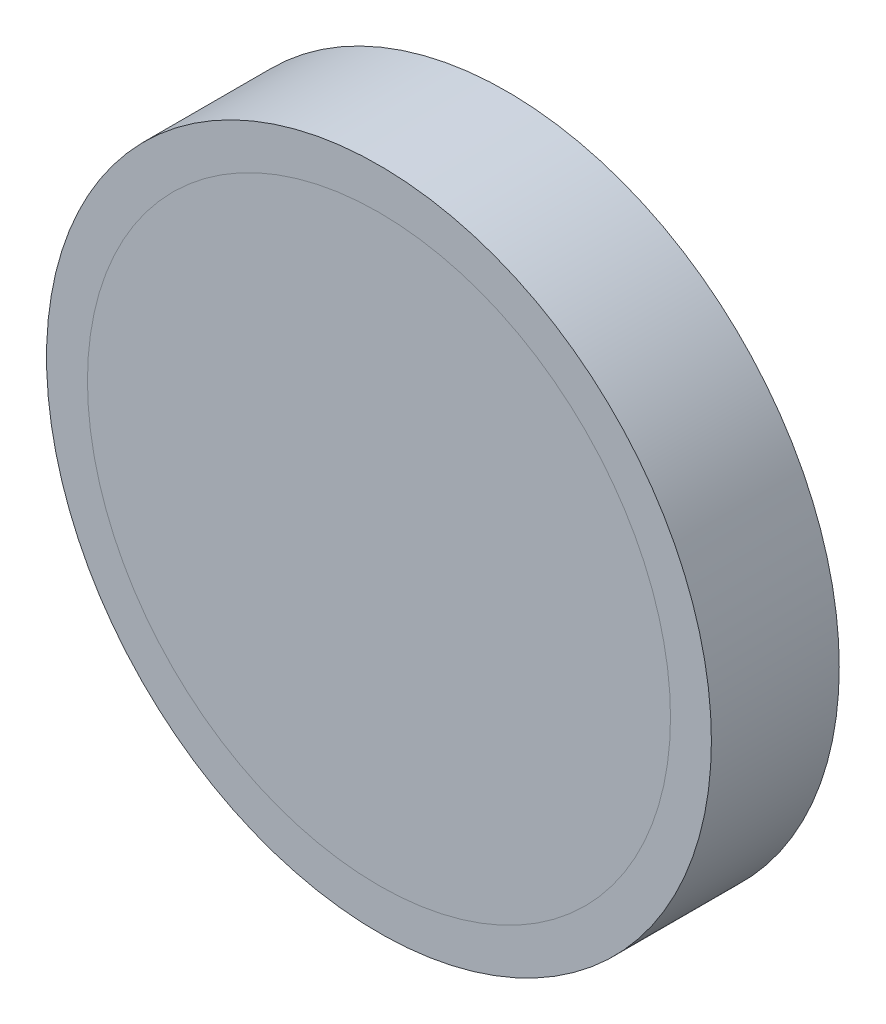
ISO-10303-21;
HEADER;
FILE_DESCRIPTION(('STEP AP214'),'2;1');
FILE_NAME('part.step','',(''),(''),'','','');
FILE_SCHEMA(('AUTOMOTIVE_DESIGN { 1 0 10303 214 1 1 1 1 }'));
ENDSEC;
DATA;
#1=APPLICATION_CONTEXT('core data for automotive mechanical design processes');
#2=APPLICATION_PROTOCOL_DEFINITION('international standard','automotive_design',2000,#1);
#3=PRODUCT_CONTEXT('',#1,'mechanical');
#4=PRODUCT('Part','Part','',(#3));
#5=PRODUCT_RELATED_PRODUCT_CATEGORY('part','',(#4));
#6=PRODUCT_DEFINITION_FORMATION('','',#4);
#7=PRODUCT_DEFINITION_CONTEXT('part definition',#1,'design');
#8=PRODUCT_DEFINITION('design','',#6,#7);
#9=PRODUCT_DEFINITION_SHAPE('','',#8);
#10=(LENGTH_UNIT() NAMED_UNIT(*) SI_UNIT(.MILLI.,.METRE.));
#11=(NAMED_UNIT(*) PLANE_ANGLE_UNIT() SI_UNIT($,.RADIAN.));
#12=(NAMED_UNIT(*) SI_UNIT($,.STERADIAN.) SOLID_ANGLE_UNIT());
#13=UNCERTAINTY_MEASURE_WITH_UNIT(LENGTH_MEASURE(1.E-05),#10,'distance_accuracy_value','');
#14=(GEOMETRIC_REPRESENTATION_CONTEXT(3) GLOBAL_UNCERTAINTY_ASSIGNED_CONTEXT((#13)) GLOBAL_UNIT_ASSIGNED_CONTEXT((#10,
#11,#12)) REPRESENTATION_CONTEXT('',''));
#15=CARTESIAN_POINT('',(0.,0.,0.));
#16=DIRECTION('',(0.,0.,1.));
#17=DIRECTION('',(1.,0.,0.));
#18=AXIS2_PLACEMENT_3D('',#15,#16,#17);
#19=CARTESIAN_POINT('',(-6.73100000000104,-165.719229699864,1.58750000000016));
#20=DIRECTION('',(0.,0.,1.));
#21=DIRECTION('',(1.00000000000002,0.,0.));
#22=AXIS2_PLACEMENT_3D('',#19,#20,#21);
#23=PLANE('',#22);
#24=CARTESIAN_POINT('',(-6.73100000000104,-165.719229699864,1.58750000000016));
#25=DIRECTION('',(0.,0.,1.));
#26=DIRECTION('',(1.00000000000002,0.,0.));
#27=AXIS2_PLACEMENT_3D('',#24,#25,#26);
#28=CIRCLE('',#27,3.61950000000001);
#29=CARTESIAN_POINT('',(-3.11150000000097,-165.719229699864,1.58750000000016));
#30=VERTEX_POINT('',#29);
#31=EDGE_CURVE('E12',#30,#30,#28,.T.);
#32=ORIENTED_EDGE('',*,*,#31,.T.);
#33=EDGE_LOOP('',(#32));
#34=FACE_BOUND('',#33,.T.);
#35=ADVANCED_FACE('F104',(#34),#23,.T.);
#36=CARTESIAN_POINT('',(-6.73100000000104,-165.719229699864,1.58750000000016));
#37=DIRECTION('',(0.,0.,-1.));
#38=DIRECTION('',(-1.00000000000002,0.,0.));
#39=AXIS2_PLACEMENT_3D('',#36,#37,#38);
#40=CYLINDRICAL_SURFACE('',#39,4.12750000000001);
#41=CARTESIAN_POINT('',(-6.73100000000104,-165.719229699864,1.58750000000016));
#42=DIRECTION('',(0.,0.,1.));
#43=DIRECTION('',(1.00000000000002,0.,0.));
#44=AXIS2_PLACEMENT_3D('',#41,#42,#43);
#45=CIRCLE('',#44,4.12750000000001);
#46=CARTESIAN_POINT('',(-2.60350000000096,-165.719229699864,1.58750000000016));
#47=VERTEX_POINT('',#46);
#48=EDGE_CURVE('E112',#47,#47,#45,.T.);
#49=ORIENTED_EDGE('',*,*,#48,.F.);
#50=EDGE_LOOP('',(#49));
#51=FACE_BOUND('',#50,.T.);
#52=CARTESIAN_POINT('',(-6.73100000000121,-165.719229699864,1.66533453693773E-13));
#53=DIRECTION('',(0.,0.,1.));
#54=DIRECTION('',(1.00000000000002,0.,0.));
#55=AXIS2_PLACEMENT_3D('',#52,#53,#54);
#56=CIRCLE('',#55,4.12750000000001);
#57=CARTESIAN_POINT('',(-2.60350000000113,-165.719229699864,1.66533453693774E-13));
#58=VERTEX_POINT('',#57);
#59=EDGE_CURVE('E119',#58,#58,#56,.T.);
#60=ORIENTED_EDGE('',*,*,#59,.T.);
#61=EDGE_LOOP('',(#60));
#62=FACE_BOUND('',#61,.T.);
#63=ADVANCED_FACE('F106',(#51,#62),#40,.T.);
#64=ORIENTED_EDGE('',*,*,#31,.F.);
#65=EDGE_LOOP('',(#64));
#66=FACE_BOUND('',#65,.T.);
#67=ORIENTED_EDGE('',*,*,#48,.T.);
#68=EDGE_LOOP('',(#67));
#69=FACE_BOUND('',#68,.T.);
#70=ADVANCED_FACE('F131',(#66,#69),#23,.T.);
#71=CARTESIAN_POINT('',(-6.73100000000121,-165.719229699864,1.66533453693773E-13));
#72=DIRECTION('',(0.,0.,1.));
#73=DIRECTION('',(1.00000000000002,0.,0.));
#74=AXIS2_PLACEMENT_3D('',#71,#72,#73);
#75=PLANE('',#74);
#76=ORIENTED_EDGE('',*,*,#59,.F.);
#77=EDGE_LOOP('',(#76));
#78=FACE_BOUND('',#77,.T.);
#79=ADVANCED_FACE('F129',(#78),#75,.F.);
#80=CLOSED_SHELL('',(#35,#63,#70,#79));
#81=MANIFOLD_SOLID_BREP('B2',#80);
#82=ADVANCED_BREP_SHAPE_REPRESENTATION('',(#18,#81),#14);
#83=SHAPE_DEFINITION_REPRESENTATION(#9,#82);
ENDSEC;
END-ISO-10303-21;
